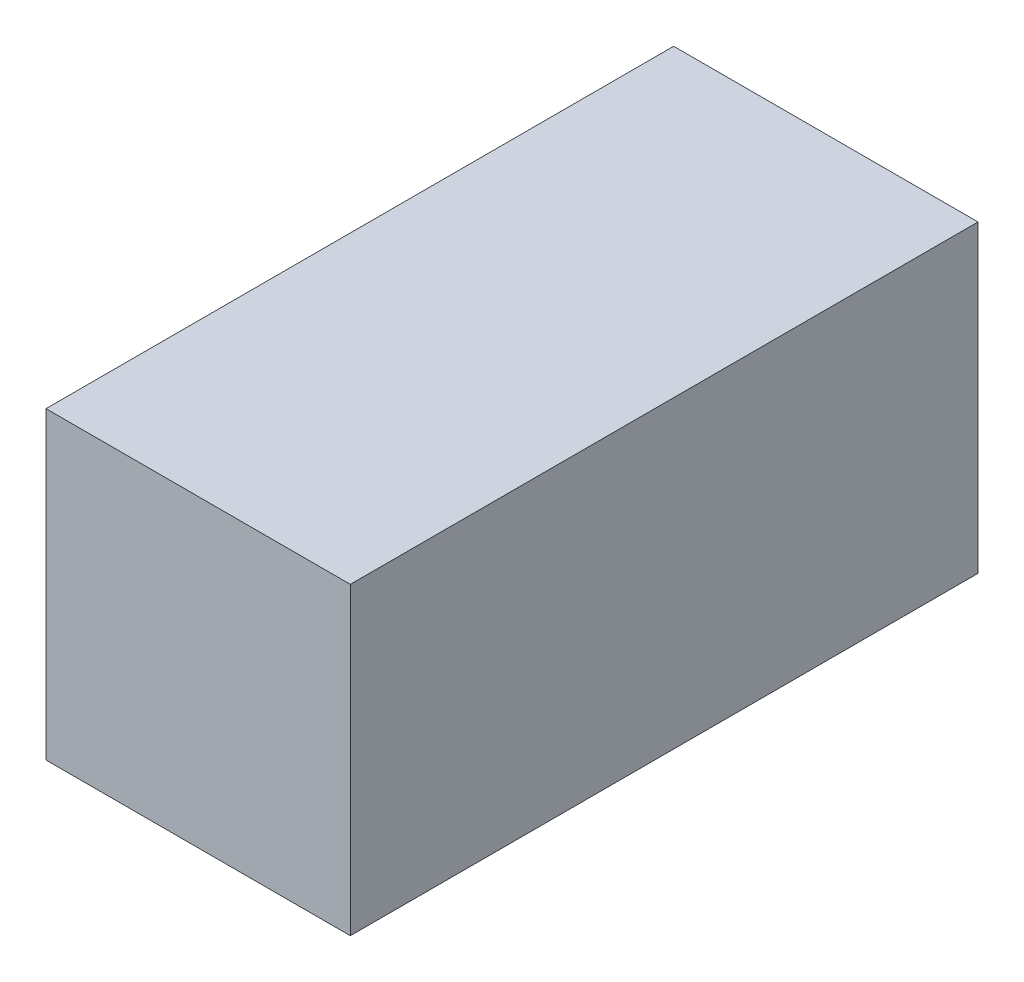
ISO-10303-21;
HEADER;
FILE_DESCRIPTION(('STEP AP214'),'2;1');
FILE_NAME('part.step','',(''),(''),'','','');
FILE_SCHEMA(('AUTOMOTIVE_DESIGN { 1 0 10303 214 1 1 1 1 }'));
ENDSEC;
DATA;
#1=APPLICATION_CONTEXT('core data for automotive mechanical design processes');
#2=APPLICATION_PROTOCOL_DEFINITION('international standard','automotive_design',2000,#1);
#3=PRODUCT_CONTEXT('',#1,'mechanical');
#4=PRODUCT('Part','Part','',(#3));
#5=PRODUCT_RELATED_PRODUCT_CATEGORY('part','',(#4));
#6=PRODUCT_DEFINITION_FORMATION('','',#4);
#7=PRODUCT_DEFINITION_CONTEXT('part definition',#1,'design');
#8=PRODUCT_DEFINITION('design','',#6,#7);
#9=PRODUCT_DEFINITION_SHAPE('','',#8);
#10=(LENGTH_UNIT() NAMED_UNIT(*) SI_UNIT(.MILLI.,.METRE.));
#11=(NAMED_UNIT(*) PLANE_ANGLE_UNIT() SI_UNIT($,.RADIAN.));
#12=(NAMED_UNIT(*) SI_UNIT($,.STERADIAN.) SOLID_ANGLE_UNIT());
#13=UNCERTAINTY_MEASURE_WITH_UNIT(LENGTH_MEASURE(1.E-05),#10,'distance_accuracy_value','');
#14=(GEOMETRIC_REPRESENTATION_CONTEXT(3) GLOBAL_UNCERTAINTY_ASSIGNED_CONTEXT((#13)) GLOBAL_UNIT_ASSIGNED_CONTEXT((#10,
#11,#12)) REPRESENTATION_CONTEXT('',''));
#15=CARTESIAN_POINT('',(0.,0.,0.));
#16=DIRECTION('',(0.,0.,1.));
#17=DIRECTION('',(1.,0.,0.));
#18=AXIS2_PLACEMENT_3D('',#15,#16,#17);
#19=CARTESIAN_POINT('',(-30.9498127340824,23.5205992509363,165.));
#20=DIRECTION('',(1.,0.,0.));
#21=DIRECTION('',(0.,1.,0.));
#22=AXIS2_PLACEMENT_3D('',#19,#20,#21);
#23=PLANE('',#22);
#24=DIRECTION('',(0.,-1.,0.));
#25=VECTOR('',#24,1.);
#26=CARTESIAN_POINT('',(-30.9498127340824,23.5205992509363,0.));
#27=LINE('',#26,#25);
#28=CARTESIAN_POINT('',(-30.9498127340824,23.5205992509363,0.));
#29=VERTEX_POINT('',#28);
#30=CARTESIAN_POINT('',(-30.9498127340824,-56.4794007490637,0.));
#31=VERTEX_POINT('',#30);
#32=EDGE_CURVE('E96',#29,#31,#27,.T.);
#33=ORIENTED_EDGE('',*,*,#32,.T.);
#34=DIRECTION('',(0.,0.,-1.));
#35=VECTOR('',#34,1.);
#36=CARTESIAN_POINT('',(-30.9498127340824,-56.4794007490637,165.));
#37=LINE('',#36,#35);
#38=CARTESIAN_POINT('',(-30.9498127340824,-56.4794007490637,165.));
#39=VERTEX_POINT('',#38);
#40=EDGE_CURVE('E11',#39,#31,#37,.T.);
#41=ORIENTED_EDGE('',*,*,#40,.F.);
#42=DIRECTION('',(0.,-1.,0.));
#43=VECTOR('',#42,1.);
#44=CARTESIAN_POINT('',(-30.9498127340824,23.5205992509363,165.));
#45=LINE('',#44,#43);
#46=CARTESIAN_POINT('',(-30.9498127340824,23.5205992509363,165.));
#47=VERTEX_POINT('',#46);
#48=EDGE_CURVE('E84',#47,#39,#45,.T.);
#49=ORIENTED_EDGE('',*,*,#48,.F.);
#50=DIRECTION('',(0.,0.,-1.));
#51=VECTOR('',#50,1.);
#52=CARTESIAN_POINT('',(-30.9498127340824,23.5205992509363,165.));
#53=LINE('',#52,#51);
#54=EDGE_CURVE('E92',#47,#29,#53,.T.);
#55=ORIENTED_EDGE('',*,*,#54,.T.);
#56=EDGE_LOOP('',(#33,#41,#49,#55));
#57=FACE_BOUND('',#56,.T.);
#58=ADVANCED_FACE('F33',(#57),#23,.F.);
#59=CARTESIAN_POINT('',(-30.9498127340824,-56.4794007490637,165.));
#60=DIRECTION('',(0.,1.,0.));
#61=DIRECTION('',(0.,0.,1.));
#62=AXIS2_PLACEMENT_3D('',#59,#60,#61);
#63=PLANE('',#62);
#64=DIRECTION('',(1.,0.,0.));
#65=VECTOR('',#64,1.);
#66=CARTESIAN_POINT('',(-30.9498127340824,-56.4794007490637,0.));
#67=LINE('',#66,#65);
#68=CARTESIAN_POINT('',(49.0501872659176,-56.4794007490637,0.));
#69=VERTEX_POINT('',#68);
#70=EDGE_CURVE('E88',#31,#69,#67,.T.);
#71=ORIENTED_EDGE('',*,*,#70,.T.);
#72=DIRECTION('',(0.,0.,-1.));
#73=VECTOR('',#72,1.);
#74=CARTESIAN_POINT('',(49.0501872659176,-56.4794007490637,165.));
#75=LINE('',#74,#73);
#76=CARTESIAN_POINT('',(49.0501872659176,-56.4794007490637,165.));
#77=VERTEX_POINT('',#76);
#78=EDGE_CURVE('E41',#77,#69,#75,.T.);
#79=ORIENTED_EDGE('',*,*,#78,.F.);
#80=DIRECTION('',(1.,0.,0.));
#81=VECTOR('',#80,1.);
#82=CARTESIAN_POINT('',(-30.9498127340824,-56.4794007490637,165.));
#83=LINE('',#82,#81);
#84=EDGE_CURVE('E79',#39,#77,#83,.T.);
#85=ORIENTED_EDGE('',*,*,#84,.F.);
#86=ORIENTED_EDGE('',*,*,#40,.T.);
#87=EDGE_LOOP('',(#71,#79,#85,#86));
#88=FACE_BOUND('',#87,.T.);
#89=ADVANCED_FACE('F87',(#88),#63,.F.);
#90=CARTESIAN_POINT('',(49.0501872659176,23.5205992509363,165.));
#91=DIRECTION('',(-1.,0.,0.));
#92=DIRECTION('',(0.,-1.,0.));
#93=AXIS2_PLACEMENT_3D('',#90,#91,#92);
#94=PLANE('',#93);
#95=DIRECTION('',(0.,1.,0.));
#96=VECTOR('',#95,1.);
#97=CARTESIAN_POINT('',(49.0501872659176,23.5205992509363,0.));
#98=LINE('',#97,#96);
#99=CARTESIAN_POINT('',(49.0501872659176,23.5205992509363,0.));
#100=VERTEX_POINT('',#99);
#101=EDGE_CURVE('E66',#69,#100,#98,.T.);
#102=ORIENTED_EDGE('',*,*,#101,.T.);
#103=DIRECTION('',(0.,0.,-1.));
#104=VECTOR('',#103,1.);
#105=CARTESIAN_POINT('',(49.0501872659176,23.5205992509363,165.));
#106=LINE('',#105,#104);
#107=CARTESIAN_POINT('',(49.0501872659176,23.5205992509363,165.));
#108=VERTEX_POINT('',#107);
#109=EDGE_CURVE('E89',#108,#100,#106,.T.);
#110=ORIENTED_EDGE('',*,*,#109,.F.);
#111=DIRECTION('',(0.,1.,0.));
#112=VECTOR('',#111,1.);
#113=CARTESIAN_POINT('',(49.0501872659176,23.5205992509363,165.));
#114=LINE('',#113,#112);
#115=EDGE_CURVE('E82',#77,#108,#114,.T.);
#116=ORIENTED_EDGE('',*,*,#115,.F.);
#117=ORIENTED_EDGE('',*,*,#78,.T.);
#118=EDGE_LOOP('',(#102,#110,#116,#117));
#119=FACE_BOUND('',#118,.T.);
#120=ADVANCED_FACE('F90',(#119),#94,.F.);
#121=CARTESIAN_POINT('',(-30.9498127340824,23.5205992509363,165.));
#122=DIRECTION('',(0.,-1.,0.));
#123=DIRECTION('',(0.,0.,-1.));
#124=AXIS2_PLACEMENT_3D('',#121,#122,#123);
#125=PLANE('',#124);
#126=DIRECTION('',(-1.,0.,0.));
#127=VECTOR('',#126,1.);
#128=CARTESIAN_POINT('',(-30.9498127340824,23.5205992509363,0.));
#129=LINE('',#128,#127);
#130=EDGE_CURVE('E72',#100,#29,#129,.T.);
#131=ORIENTED_EDGE('',*,*,#130,.T.);
#132=ORIENTED_EDGE('',*,*,#54,.F.);
#133=DIRECTION('',(-1.,0.,0.));
#134=VECTOR('',#133,1.);
#135=CARTESIAN_POINT('',(-30.9498127340824,23.5205992509363,165.));
#136=LINE('',#135,#134);
#137=EDGE_CURVE('E49',#108,#47,#136,.T.);
#138=ORIENTED_EDGE('',*,*,#137,.F.);
#139=ORIENTED_EDGE('',*,*,#109,.T.);
#140=EDGE_LOOP('',(#131,#132,#138,#139));
#141=FACE_BOUND('',#140,.T.);
#142=ADVANCED_FACE('F103',(#141),#125,.F.);
#143=CARTESIAN_POINT('',(0.,0.,165.));
#144=DIRECTION('',(0.,0.,1.));
#145=DIRECTION('',(1.,0.,0.));
#146=AXIS2_PLACEMENT_3D('',#143,#144,#145);
#147=PLANE('',#146);
#148=ORIENTED_EDGE('',*,*,#48,.T.);
#149=ORIENTED_EDGE('',*,*,#84,.T.);
#150=ORIENTED_EDGE('',*,*,#115,.T.);
#151=ORIENTED_EDGE('',*,*,#137,.T.);
#152=EDGE_LOOP('',(#148,#149,#150,#151));
#153=FACE_BOUND('',#152,.T.);
#154=ADVANCED_FACE('F80',(#153),#147,.T.);
#155=CARTESIAN_POINT('',(0.,0.,0.));
#156=DIRECTION('',(0.,0.,1.));
#157=DIRECTION('',(1.,0.,0.));
#158=AXIS2_PLACEMENT_3D('',#155,#156,#157);
#159=PLANE('',#158);
#160=ORIENTED_EDGE('',*,*,#32,.F.);
#161=ORIENTED_EDGE('',*,*,#130,.F.);
#162=ORIENTED_EDGE('',*,*,#101,.F.);
#163=ORIENTED_EDGE('',*,*,#70,.F.);
#164=EDGE_LOOP('',(#160,#161,#162,#163));
#165=FACE_BOUND('',#164,.T.);
#166=ADVANCED_FACE('F106',(#165),#159,.F.);
#167=CLOSED_SHELL('',(#58,#89,#120,#142,#154,#166));
#168=MANIFOLD_SOLID_BREP('B2',#167);
#169=ADVANCED_BREP_SHAPE_REPRESENTATION('',(#18,#168),#14);
#170=SHAPE_DEFINITION_REPRESENTATION(#9,#169);
ENDSEC;
END-ISO-10303-21;
